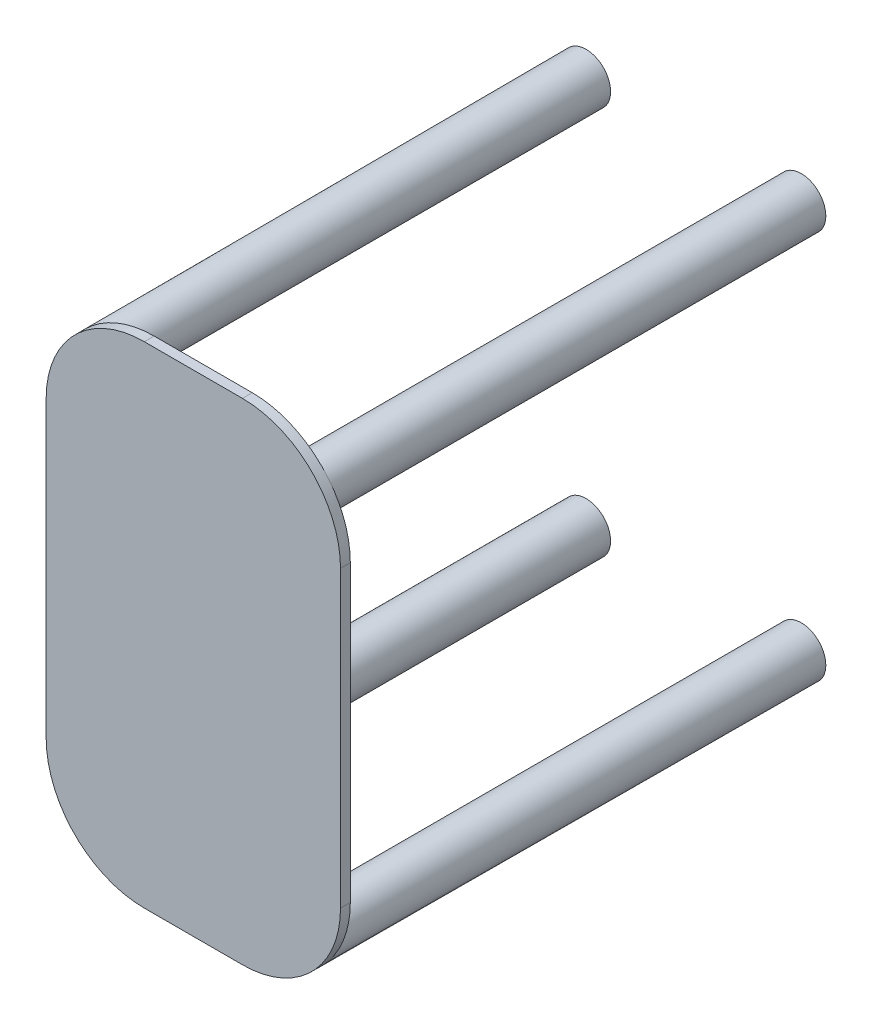
ISO-10303-21;
HEADER;
FILE_DESCRIPTION(('STEP AP214'),'2;1');
FILE_NAME('part.step','',(''),(''),'','','');
FILE_SCHEMA(('AUTOMOTIVE_DESIGN { 1 0 10303 214 1 1 1 1 }'));
ENDSEC;
DATA;
#1=APPLICATION_CONTEXT('core data for automotive mechanical design processes');
#2=APPLICATION_PROTOCOL_DEFINITION('international standard','automotive_design',2000,#1);
#3=PRODUCT_CONTEXT('',#1,'mechanical');
#4=PRODUCT('Part','Part','',(#3));
#5=PRODUCT_RELATED_PRODUCT_CATEGORY('part','',(#4));
#6=PRODUCT_DEFINITION_FORMATION('','',#4);
#7=PRODUCT_DEFINITION_CONTEXT('part definition',#1,'design');
#8=PRODUCT_DEFINITION('design','',#6,#7);
#9=PRODUCT_DEFINITION_SHAPE('','',#8);
#10=(LENGTH_UNIT() NAMED_UNIT(*) SI_UNIT(.MILLI.,.METRE.));
#11=(NAMED_UNIT(*) PLANE_ANGLE_UNIT() SI_UNIT($,.RADIAN.));
#12=(NAMED_UNIT(*) SI_UNIT($,.STERADIAN.) SOLID_ANGLE_UNIT());
#13=UNCERTAINTY_MEASURE_WITH_UNIT(LENGTH_MEASURE(1.E-05),#10,'distance_accuracy_value','');
#14=(GEOMETRIC_REPRESENTATION_CONTEXT(3) GLOBAL_UNCERTAINTY_ASSIGNED_CONTEXT((#13)) GLOBAL_UNIT_ASSIGNED_CONTEXT((#10,
#11,#12)) REPRESENTATION_CONTEXT('',''));
#15=CARTESIAN_POINT('',(0.,0.,0.));
#16=DIRECTION('',(0.,0.,1.));
#17=DIRECTION('',(1.,0.,0.));
#18=AXIS2_PLACEMENT_3D('',#15,#16,#17);
#19=CARTESIAN_POINT('',(-0.05,-0.15,0.01));
#20=DIRECTION('',(0.,0.,-1.));
#21=DIRECTION('',(-1.,0.,0.));
#22=AXIS2_PLACEMENT_3D('',#19,#20,#21);
#23=CYLINDRICAL_SURFACE('',#22,0.1);
#24=CARTESIAN_POINT('',(-0.05,-0.15,0.));
#25=DIRECTION('',(0.,0.,1.));
#26=DIRECTION('',(1.,0.,0.));
#27=AXIS2_PLACEMENT_3D('',#24,#25,#26);
#28=CIRCLE('',#27,0.1);
#29=CARTESIAN_POINT('',(-0.15,-0.15,0.));
#30=VERTEX_POINT('',#29);
#31=CARTESIAN_POINT('',(-0.133938065766945,-0.204354402906334,0.));
#32=VERTEX_POINT('',#31);
#33=EDGE_CURVE('E174',#30,#32,#28,.T.);
#34=ORIENTED_EDGE('',*,*,#33,.T.);
#35=CARTESIAN_POINT('',(-0.05,-0.15,0.));
#36=DIRECTION('',(0.,0.,1.));
#37=DIRECTION('',(-0.839380657669449,-0.543544029063335,0.));
#38=AXIS2_PLACEMENT_3D('',#35,#36,#37);
#39=CIRCLE('',#38,0.1);
#40=CARTESIAN_POINT('',(-0.120710678118655,-0.220710678118655,0.));
#41=VERTEX_POINT('',#40);
#42=EDGE_CURVE('E176',#32,#41,#39,.T.);
#43=ORIENTED_EDGE('',*,*,#42,.T.);
#44=CARTESIAN_POINT('',(-0.05,-0.25,0.));
#45=VERTEX_POINT('',#44);
#46=EDGE_CURVE('E187',#41,#45,#28,.T.);
#47=ORIENTED_EDGE('',*,*,#46,.T.);
#48=DIRECTION('',(0.,0.,-1.));
#49=VECTOR('',#48,1.);
#50=CARTESIAN_POINT('',(-0.05,-0.25,0.01));
#51=LINE('',#50,#49);
#52=CARTESIAN_POINT('',(-0.05,-0.25,0.01));
#53=VERTEX_POINT('',#52);
#54=EDGE_CURVE('E328',#53,#45,#51,.T.);
#55=ORIENTED_EDGE('',*,*,#54,.F.);
#56=CARTESIAN_POINT('',(-0.05,-0.15,0.01));
#57=DIRECTION('',(0.,0.,1.));
#58=DIRECTION('',(1.,0.,0.));
#59=AXIS2_PLACEMENT_3D('',#56,#57,#58);
#60=CIRCLE('',#59,0.1);
#61=CARTESIAN_POINT('',(-0.15,-0.15,0.01));
#62=VERTEX_POINT('',#61);
#63=EDGE_CURVE('E240',#62,#53,#60,.T.);
#64=ORIENTED_EDGE('',*,*,#63,.F.);
#65=DIRECTION('',(0.,0.,-1.));
#66=VECTOR('',#65,1.);
#67=CARTESIAN_POINT('',(-0.15,-0.15,0.01));
#68=LINE('',#67,#66);
#69=EDGE_CURVE('E180',#62,#30,#68,.T.);
#70=ORIENTED_EDGE('',*,*,#69,.T.);
#71=EDGE_LOOP('',(#34,#43,#47,#55,#64,#70));
#72=FACE_BOUND('',#71,.T.);
#73=ADVANCED_FACE('F39',(#72),#23,.T.);
#74=CARTESIAN_POINT('',(-0.05,-0.25,0.01));
#75=DIRECTION('',(0.,1.,0.));
#76=DIRECTION('',(0.,0.,1.));
#77=AXIS2_PLACEMENT_3D('',#74,#75,#76);
#78=PLANE('',#77);
#79=DIRECTION('',(1.,0.,0.));
#80=VECTOR('',#79,1.);
#81=CARTESIAN_POINT('',(-0.05,-0.25,0.));
#82=LINE('',#81,#80);
#83=CARTESIAN_POINT('',(0.0499999999999999,-0.25,0.));
#84=VERTEX_POINT('',#83);
#85=EDGE_CURVE('E148',#45,#84,#82,.T.);
#86=ORIENTED_EDGE('',*,*,#85,.T.);
#87=DIRECTION('',(0.,0.,-1.));
#88=VECTOR('',#87,1.);
#89=CARTESIAN_POINT('',(0.0499999999999999,-0.25,0.01));
#90=LINE('',#89,#88);
#91=CARTESIAN_POINT('',(0.0499999999999999,-0.25,0.01));
#92=VERTEX_POINT('',#91);
#93=EDGE_CURVE('E325',#92,#84,#90,.T.);
#94=ORIENTED_EDGE('',*,*,#93,.F.);
#95=DIRECTION('',(1.,0.,0.));
#96=VECTOR('',#95,1.);
#97=CARTESIAN_POINT('',(-0.05,-0.25,0.01));
#98=LINE('',#97,#96);
#99=EDGE_CURVE('E391',#53,#92,#98,.T.);
#100=ORIENTED_EDGE('',*,*,#99,.F.);
#101=ORIENTED_EDGE('',*,*,#54,.T.);
#102=EDGE_LOOP('',(#86,#94,#100,#101));
#103=FACE_BOUND('',#102,.T.);
#104=ADVANCED_FACE('F167',(#103),#78,.F.);
#105=CARTESIAN_POINT('',(0.0499999999999999,-0.15,0.01));
#106=DIRECTION('',(0.,0.,-1.));
#107=DIRECTION('',(-1.,0.,0.));
#108=AXIS2_PLACEMENT_3D('',#105,#106,#107);
#109=CYLINDRICAL_SURFACE('',#108,0.1);
#110=CARTESIAN_POINT('',(0.0499999999999999,-0.15,0.));
#111=DIRECTION('',(0.,0.,1.));
#112=DIRECTION('',(1.,0.,0.));
#113=AXIS2_PLACEMENT_3D('',#110,#111,#112);
#114=CIRCLE('',#113,0.1);
#115=CARTESIAN_POINT('',(0.120710678118655,-0.220710678118655,0.));
#116=VERTEX_POINT('',#115);
#117=EDGE_CURVE('E137',#84,#116,#114,.T.);
#118=ORIENTED_EDGE('',*,*,#117,.T.);
#119=CARTESIAN_POINT('',(0.0499999999999999,-0.15,0.));
#120=DIRECTION('',(0.,0.,1.));
#121=DIRECTION('',(0.707106781186548,-0.707106781186547,0.));
#122=AXIS2_PLACEMENT_3D('',#119,#120,#121);
#123=CIRCLE('',#122,0.1);
#124=CARTESIAN_POINT('',(0.133938065766945,-0.204354402906333,0.));
#125=VERTEX_POINT('',#124);
#126=EDGE_CURVE('E131',#116,#125,#123,.T.);
#127=ORIENTED_EDGE('',*,*,#126,.T.);
#128=CARTESIAN_POINT('',(0.15,-0.15,0.));
#129=VERTEX_POINT('',#128);
#130=EDGE_CURVE('E43',#125,#129,#114,.T.);
#131=ORIENTED_EDGE('',*,*,#130,.T.);
#132=DIRECTION('',(0.,0.,-1.));
#133=VECTOR('',#132,1.);
#134=CARTESIAN_POINT('',(0.15,-0.15,0.01));
#135=LINE('',#134,#133);
#136=CARTESIAN_POINT('',(0.15,-0.15,0.01));
#137=VERTEX_POINT('',#136);
#138=EDGE_CURVE('E322',#137,#129,#135,.T.);
#139=ORIENTED_EDGE('',*,*,#138,.F.);
#140=CARTESIAN_POINT('',(0.0499999999999999,-0.15,0.01));
#141=DIRECTION('',(0.,0.,1.));
#142=DIRECTION('',(1.,0.,0.));
#143=AXIS2_PLACEMENT_3D('',#140,#141,#142);
#144=CIRCLE('',#143,0.1);
#145=EDGE_CURVE('E393',#92,#137,#144,.T.);
#146=ORIENTED_EDGE('',*,*,#145,.F.);
#147=ORIENTED_EDGE('',*,*,#93,.T.);
#148=EDGE_LOOP('',(#118,#127,#131,#139,#146,#147));
#149=FACE_BOUND('',#148,.T.);
#150=ADVANCED_FACE('F133',(#149),#109,.T.);
#151=CARTESIAN_POINT('',(0.15,-0.15,0.01));
#152=DIRECTION('',(-1.,0.,0.));
#153=DIRECTION('',(0.,0.,1.));
#154=AXIS2_PLACEMENT_3D('',#151,#152,#153);
#155=PLANE('',#154);
#156=DIRECTION('',(0.,1.,0.));
#157=VECTOR('',#156,1.);
#158=CARTESIAN_POINT('',(0.15,-0.15,0.));
#159=LINE('',#158,#157);
#160=CARTESIAN_POINT('',(0.15,0.15,0.));
#161=VERTEX_POINT('',#160);
#162=EDGE_CURVE('E146',#129,#161,#159,.T.);
#163=ORIENTED_EDGE('',*,*,#162,.T.);
#164=DIRECTION('',(0.,0.,-1.));
#165=VECTOR('',#164,1.);
#166=CARTESIAN_POINT('',(0.15,0.15,0.01));
#167=LINE('',#166,#165);
#168=CARTESIAN_POINT('',(0.15,0.15,0.01));
#169=VERTEX_POINT('',#168);
#170=EDGE_CURVE('E318',#169,#161,#167,.T.);
#171=ORIENTED_EDGE('',*,*,#170,.F.);
#172=DIRECTION('',(0.,1.,0.));
#173=VECTOR('',#172,1.);
#174=CARTESIAN_POINT('',(0.15,-0.15,0.01));
#175=LINE('',#174,#173);
#176=EDGE_CURVE('E395',#137,#169,#175,.T.);
#177=ORIENTED_EDGE('',*,*,#176,.F.);
#178=ORIENTED_EDGE('',*,*,#138,.T.);
#179=EDGE_LOOP('',(#163,#171,#177,#178));
#180=FACE_BOUND('',#179,.T.);
#181=ADVANCED_FACE('F366',(#180),#155,.F.);
#182=CARTESIAN_POINT('',(0.0499999999999999,0.15,0.01));
#183=DIRECTION('',(0.,0.,-1.));
#184=DIRECTION('',(-1.,0.,0.));
#185=AXIS2_PLACEMENT_3D('',#182,#183,#184);
#186=CYLINDRICAL_SURFACE('',#185,0.1);
#187=CARTESIAN_POINT('',(0.0499999999999999,0.15,0.));
#188=DIRECTION('',(0.,0.,1.));
#189=DIRECTION('',(1.,0.,0.));
#190=AXIS2_PLACEMENT_3D('',#187,#188,#189);
#191=CIRCLE('',#190,0.1);
#192=CARTESIAN_POINT('',(0.133938065766945,0.204354402906333,0.));
#193=VERTEX_POINT('',#192);
#194=EDGE_CURVE('E340',#161,#193,#191,.T.);
#195=ORIENTED_EDGE('',*,*,#194,.T.);
#196=CARTESIAN_POINT('',(0.0499999999999999,0.15,0.));
#197=DIRECTION('',(0.,0.,1.));
#198=DIRECTION('',(0.839380657669449,0.543544029063335,0.));
#199=AXIS2_PLACEMENT_3D('',#196,#197,#198);
#200=CIRCLE('',#199,0.1);
#201=CARTESIAN_POINT('',(0.120710678118655,0.220710678118655,0.));
#202=VERTEX_POINT('',#201);
#203=EDGE_CURVE('E236',#193,#202,#200,.T.);
#204=ORIENTED_EDGE('',*,*,#203,.T.);
#205=CARTESIAN_POINT('',(0.0499999999999999,0.25,0.));
#206=VERTEX_POINT('',#205);
#207=EDGE_CURVE('E343',#202,#206,#191,.T.);
#208=ORIENTED_EDGE('',*,*,#207,.T.);
#209=DIRECTION('',(0.,0.,-1.));
#210=VECTOR('',#209,1.);
#211=CARTESIAN_POINT('',(0.0499999999999999,0.25,0.01));
#212=LINE('',#211,#210);
#213=CARTESIAN_POINT('',(0.0499999999999999,0.25,0.01));
#214=VERTEX_POINT('',#213);
#215=EDGE_CURVE('E314',#214,#206,#212,.T.);
#216=ORIENTED_EDGE('',*,*,#215,.F.);
#217=CARTESIAN_POINT('',(0.0499999999999999,0.15,0.01));
#218=DIRECTION('',(0.,0.,1.));
#219=DIRECTION('',(1.,0.,0.));
#220=AXIS2_PLACEMENT_3D('',#217,#218,#219);
#221=CIRCLE('',#220,0.1);
#222=EDGE_CURVE('E398',#169,#214,#221,.T.);
#223=ORIENTED_EDGE('',*,*,#222,.F.);
#224=ORIENTED_EDGE('',*,*,#170,.T.);
#225=EDGE_LOOP('',(#195,#204,#208,#216,#223,#224));
#226=FACE_BOUND('',#225,.T.);
#227=ADVANCED_FACE('F368',(#226),#186,.T.);
#228=CARTESIAN_POINT('',(-0.05,0.25,0.01));
#229=DIRECTION('',(0.,-1.,0.));
#230=DIRECTION('',(0.,0.,-1.));
#231=AXIS2_PLACEMENT_3D('',#228,#229,#230);
#232=PLANE('',#231);
#233=DIRECTION('',(-1.,0.,0.));
#234=VECTOR('',#233,1.);
#235=CARTESIAN_POINT('',(-0.05,0.25,0.));
#236=LINE('',#235,#234);
#237=CARTESIAN_POINT('',(-0.05,0.25,0.));
#238=VERTEX_POINT('',#237);
#239=EDGE_CURVE('E298',#206,#238,#236,.T.);
#240=ORIENTED_EDGE('',*,*,#239,.T.);
#241=DIRECTION('',(0.,0.,-1.));
#242=VECTOR('',#241,1.);
#243=CARTESIAN_POINT('',(-0.05,0.25,0.01));
#244=LINE('',#243,#242);
#245=CARTESIAN_POINT('',(-0.05,0.25,0.01));
#246=VERTEX_POINT('',#245);
#247=EDGE_CURVE('E310',#246,#238,#244,.T.);
#248=ORIENTED_EDGE('',*,*,#247,.F.);
#249=DIRECTION('',(-1.,0.,0.));
#250=VECTOR('',#249,1.);
#251=CARTESIAN_POINT('',(-0.05,0.25,0.01));
#252=LINE('',#251,#250);
#253=EDGE_CURVE('E401',#214,#246,#252,.T.);
#254=ORIENTED_EDGE('',*,*,#253,.F.);
#255=ORIENTED_EDGE('',*,*,#215,.T.);
#256=EDGE_LOOP('',(#240,#248,#254,#255));
#257=FACE_BOUND('',#256,.T.);
#258=ADVANCED_FACE('F266',(#257),#232,.F.);
#259=CARTESIAN_POINT('',(-0.05,0.15,0.01));
#260=DIRECTION('',(0.,0.,-1.));
#261=DIRECTION('',(-1.,0.,0.));
#262=AXIS2_PLACEMENT_3D('',#259,#260,#261);
#263=CYLINDRICAL_SURFACE('',#262,0.1);
#264=CARTESIAN_POINT('',(-0.05,0.15,0.));
#265=DIRECTION('',(0.,0.,1.));
#266=DIRECTION('',(-1.,0.,0.));
#267=AXIS2_PLACEMENT_3D('',#264,#265,#266);
#268=CIRCLE('',#267,0.1);
#269=CARTESIAN_POINT('',(-0.120710678118655,0.220710678118655,0.));
#270=VERTEX_POINT('',#269);
#271=EDGE_CURVE('E287',#238,#270,#268,.T.);
#272=ORIENTED_EDGE('',*,*,#271,.T.);
#273=CARTESIAN_POINT('',(-0.05,0.15,0.));
#274=DIRECTION('',(0.,0.,1.));
#275=DIRECTION('',(-0.707106781186549,0.707106781186546,0.));
#276=AXIS2_PLACEMENT_3D('',#273,#274,#275);
#277=CIRCLE('',#276,0.1);
#278=CARTESIAN_POINT('',(-0.133938065766945,0.204354402906334,0.));
#279=VERTEX_POINT('',#278);
#280=EDGE_CURVE('E293',#270,#279,#277,.T.);
#281=ORIENTED_EDGE('',*,*,#280,.T.);
#282=CARTESIAN_POINT('',(-0.15,0.15,0.));
#283=VERTEX_POINT('',#282);
#284=EDGE_CURVE('E294',#279,#283,#268,.T.);
#285=ORIENTED_EDGE('',*,*,#284,.T.);
#286=DIRECTION('',(0.,0.,-1.));
#287=VECTOR('',#286,1.);
#288=CARTESIAN_POINT('',(-0.15,0.15,0.01));
#289=LINE('',#288,#287);
#290=CARTESIAN_POINT('',(-0.15,0.15,0.01));
#291=VERTEX_POINT('',#290);
#292=EDGE_CURVE('E305',#291,#283,#289,.T.);
#293=ORIENTED_EDGE('',*,*,#292,.F.);
#294=CARTESIAN_POINT('',(-0.05,0.15,0.01));
#295=DIRECTION('',(0.,0.,1.));
#296=DIRECTION('',(-1.,0.,0.));
#297=AXIS2_PLACEMENT_3D('',#294,#295,#296);
#298=CIRCLE('',#297,0.1);
#299=EDGE_CURVE('E404',#246,#291,#298,.T.);
#300=ORIENTED_EDGE('',*,*,#299,.F.);
#301=ORIENTED_EDGE('',*,*,#247,.T.);
#302=EDGE_LOOP('',(#272,#281,#285,#293,#300,#301));
#303=FACE_BOUND('',#302,.T.);
#304=ADVANCED_FACE('F261',(#303),#263,.T.);
#305=CARTESIAN_POINT('',(-0.15,-0.15,0.01));
#306=DIRECTION('',(1.,0.,0.));
#307=DIRECTION('',(0.,0.,-1.));
#308=AXIS2_PLACEMENT_3D('',#305,#306,#307);
#309=PLANE('',#308);
#310=DIRECTION('',(0.,-1.,0.));
#311=VECTOR('',#310,1.);
#312=CARTESIAN_POINT('',(-0.15,-0.15,0.));
#313=LINE('',#312,#311);
#314=EDGE_CURVE('E292',#283,#30,#313,.T.);
#315=ORIENTED_EDGE('',*,*,#314,.T.);
#316=ORIENTED_EDGE('',*,*,#69,.F.);
#317=DIRECTION('',(0.,-1.,0.));
#318=VECTOR('',#317,1.);
#319=CARTESIAN_POINT('',(-0.15,-0.15,0.01));
#320=LINE('',#319,#318);
#321=EDGE_CURVE('E306',#291,#62,#320,.T.);
#322=ORIENTED_EDGE('',*,*,#321,.F.);
#323=ORIENTED_EDGE('',*,*,#292,.T.);
#324=EDGE_LOOP('',(#315,#316,#322,#323));
#325=FACE_BOUND('',#324,.T.);
#326=ADVANCED_FACE('F255',(#325),#309,.F.);
#327=CARTESIAN_POINT('',(-0.05,-0.15,0.01));
#328=DIRECTION('',(0.,0.,1.));
#329=DIRECTION('',(1.,0.,0.));
#330=AXIS2_PLACEMENT_3D('',#327,#328,#329);
#331=PLANE('',#330);
#332=ORIENTED_EDGE('',*,*,#63,.T.);
#333=ORIENTED_EDGE('',*,*,#99,.T.);
#334=ORIENTED_EDGE('',*,*,#145,.T.);
#335=ORIENTED_EDGE('',*,*,#176,.T.);
#336=ORIENTED_EDGE('',*,*,#222,.T.);
#337=ORIENTED_EDGE('',*,*,#253,.T.);
#338=ORIENTED_EDGE('',*,*,#299,.T.);
#339=ORIENTED_EDGE('',*,*,#321,.T.);
#340=EDGE_LOOP('',(#332,#333,#334,#335,#336,#337,#338,#339));
#341=FACE_BOUND('',#340,.T.);
#342=ADVANCED_FACE('F252',(#341),#331,.T.);
#343=CARTESIAN_POINT('',(-0.05,-0.15,0.));
#344=DIRECTION('',(0.,0.,1.));
#345=DIRECTION('',(1.,0.,0.));
#346=AXIS2_PLACEMENT_3D('',#343,#344,#345);
#347=PLANE('',#346);
#348=CARTESIAN_POINT('',(0.109689482030028,-0.198271131849266,0.));
#349=DIRECTION('',(0.,0.,1.));
#350=DIRECTION('',(1.,0.,0.));
#351=AXIS2_PLACEMENT_3D('',#348,#349,#350);
#352=CIRCLE('',#351,0.025);
#353=EDGE_CURVE('E11',#116,#125,#352,.F.);
#354=ORIENTED_EDGE('',*,*,#353,.F.);
#355=ORIENTED_EDGE('',*,*,#117,.F.);
#356=ORIENTED_EDGE('',*,*,#85,.F.);
#357=ORIENTED_EDGE('',*,*,#46,.F.);
#358=CARTESIAN_POINT('',(-0.109689482030029,-0.198271131849266,0.));
#359=DIRECTION('',(0.,0.,1.));
#360=DIRECTION('',(1.,0.,0.));
#361=AXIS2_PLACEMENT_3D('',#358,#359,#360);
#362=CIRCLE('',#361,0.025);
#363=EDGE_CURVE('E50',#32,#41,#362,.F.);
#364=ORIENTED_EDGE('',*,*,#363,.F.);
#365=ORIENTED_EDGE('',*,*,#33,.F.);
#366=ORIENTED_EDGE('',*,*,#314,.F.);
#367=ORIENTED_EDGE('',*,*,#284,.F.);
#368=CARTESIAN_POINT('',(-0.109689482030029,0.198271131849266,0.));
#369=DIRECTION('',(0.,0.,1.));
#370=DIRECTION('',(1.,0.,0.));
#371=AXIS2_PLACEMENT_3D('',#368,#369,#370);
#372=CIRCLE('',#371,0.025);
#373=EDGE_CURVE('E275',#270,#279,#372,.F.);
#374=ORIENTED_EDGE('',*,*,#373,.F.);
#375=ORIENTED_EDGE('',*,*,#271,.F.);
#376=ORIENTED_EDGE('',*,*,#239,.F.);
#377=ORIENTED_EDGE('',*,*,#207,.F.);
#378=CARTESIAN_POINT('',(0.109689482030028,0.198271131849266,0.));
#379=DIRECTION('',(0.,0.,-1.));
#380=DIRECTION('',(-1.,0.,0.));
#381=AXIS2_PLACEMENT_3D('',#378,#379,#380);
#382=CIRCLE('',#381,0.025);
#383=EDGE_CURVE('E284',#193,#202,#382,.T.);
#384=ORIENTED_EDGE('',*,*,#383,.F.);
#385=ORIENTED_EDGE('',*,*,#194,.F.);
#386=ORIENTED_EDGE('',*,*,#162,.F.);
#387=ORIENTED_EDGE('',*,*,#130,.F.);
#388=EDGE_LOOP('',(#354,#355,#356,#357,#364,#365,#366,#367,#374,#375,#376,#377,#384,#385,#386,#387));
#389=FACE_BOUND('',#388,.T.);
#390=ADVANCED_FACE('F144',(#389),#347,.F.);
#391=CARTESIAN_POINT('',(0.109689482030028,0.198271131849266,-0.5));
#392=DIRECTION('',(0.,0.,1.));
#393=DIRECTION('',(1.,0.,0.));
#394=AXIS2_PLACEMENT_3D('',#391,#392,#393);
#395=CYLINDRICAL_SURFACE('',#394,0.025);
#396=CARTESIAN_POINT('',(0.109689482030028,0.198271131849266,-0.5));
#397=DIRECTION('',(0.,0.,-1.));
#398=DIRECTION('',(-1.,0.,0.));
#399=AXIS2_PLACEMENT_3D('',#396,#397,#398);
#400=CIRCLE('',#399,0.025);
#401=CARTESIAN_POINT('',(0.0846894820300284,0.198271131849266,-0.5));
#402=VERTEX_POINT('',#401);
#403=EDGE_CURVE('E223',#402,#402,#400,.T.);
#404=ORIENTED_EDGE('',*,*,#403,.F.);
#405=EDGE_LOOP('',(#404));
#406=FACE_BOUND('',#405,.T.);
#407=ORIENTED_EDGE('',*,*,#203,.F.);
#408=ORIENTED_EDGE('',*,*,#383,.T.);
#409=EDGE_LOOP('',(#407,#408));
#410=FACE_BOUND('',#409,.T.);
#411=ADVANCED_FACE('F242',(#406,#410),#395,.T.);
#412=CARTESIAN_POINT('',(0.109689482030028,0.198271131849266,-0.5));
#413=DIRECTION('',(0.,0.,-1.));
#414=DIRECTION('',(-1.,0.,0.));
#415=AXIS2_PLACEMENT_3D('',#412,#413,#414);
#416=PLANE('',#415);
#417=ORIENTED_EDGE('',*,*,#403,.T.);
#418=EDGE_LOOP('',(#417));
#419=FACE_BOUND('',#418,.T.);
#420=ADVANCED_FACE('F215',(#419),#416,.T.);
#421=CARTESIAN_POINT('',(-0.109689482030029,0.198271131849266,-0.5));
#422=DIRECTION('',(0.,0.,1.));
#423=DIRECTION('',(1.,0.,0.));
#424=AXIS2_PLACEMENT_3D('',#421,#422,#423);
#425=CYLINDRICAL_SURFACE('',#424,0.025);
#426=CARTESIAN_POINT('',(-0.109689482030029,0.198271131849266,-0.5));
#427=DIRECTION('',(0.,0.,-1.));
#428=DIRECTION('',(1.,0.,0.));
#429=AXIS2_PLACEMENT_3D('',#426,#427,#428);
#430=CIRCLE('',#429,0.025);
#431=CARTESIAN_POINT('',(-0.0846894820300285,0.198271131849266,-0.5));
#432=VERTEX_POINT('',#431);
#433=EDGE_CURVE('E196',#432,#432,#430,.T.);
#434=ORIENTED_EDGE('',*,*,#433,.F.);
#435=EDGE_LOOP('',(#434));
#436=FACE_BOUND('',#435,.T.);
#437=ORIENTED_EDGE('',*,*,#280,.F.);
#438=ORIENTED_EDGE('',*,*,#373,.T.);
#439=EDGE_LOOP('',(#437,#438));
#440=FACE_BOUND('',#439,.T.);
#441=ADVANCED_FACE('F210',(#436,#440),#425,.T.);
#442=CARTESIAN_POINT('',(-0.109689482030029,0.198271131849266,-0.5));
#443=DIRECTION('',(0.,0.,1.));
#444=DIRECTION('',(1.,0.,0.));
#445=AXIS2_PLACEMENT_3D('',#442,#443,#444);
#446=PLANE('',#445);
#447=ORIENTED_EDGE('',*,*,#433,.T.);
#448=EDGE_LOOP('',(#447));
#449=FACE_BOUND('',#448,.T.);
#450=ADVANCED_FACE('F206',(#449),#446,.F.);
#451=CARTESIAN_POINT('',(-0.109689482030029,-0.198271131849266,-0.5));
#452=DIRECTION('',(0.,0.,1.));
#453=DIRECTION('',(1.,0.,0.));
#454=AXIS2_PLACEMENT_3D('',#451,#452,#453);
#455=CYLINDRICAL_SURFACE('',#454,0.025);
#456=CARTESIAN_POINT('',(-0.109689482030029,-0.198271131849266,-0.5));
#457=DIRECTION('',(0.,0.,-1.));
#458=DIRECTION('',(-1.,0.,0.));
#459=AXIS2_PLACEMENT_3D('',#456,#457,#458);
#460=CIRCLE('',#459,0.025);
#461=CARTESIAN_POINT('',(-0.134689482030029,-0.198271131849266,-0.5));
#462=VERTEX_POINT('',#461);
#463=EDGE_CURVE('E190',#462,#462,#460,.T.);
#464=ORIENTED_EDGE('',*,*,#463,.F.);
#465=EDGE_LOOP('',(#464));
#466=FACE_BOUND('',#465,.T.);
#467=ORIENTED_EDGE('',*,*,#42,.F.);
#468=ORIENTED_EDGE('',*,*,#363,.T.);
#469=EDGE_LOOP('',(#467,#468));
#470=FACE_BOUND('',#469,.T.);
#471=ADVANCED_FACE('F161',(#466,#470),#455,.T.);
#472=CARTESIAN_POINT('',(-0.109689482030029,-0.198271131849266,-0.5));
#473=DIRECTION('',(0.,0.,-1.));
#474=DIRECTION('',(-1.,0.,0.));
#475=AXIS2_PLACEMENT_3D('',#472,#473,#474);
#476=PLANE('',#475);
#477=ORIENTED_EDGE('',*,*,#463,.T.);
#478=EDGE_LOOP('',(#477));
#479=FACE_BOUND('',#478,.T.);
#480=ADVANCED_FACE('F152',(#479),#476,.T.);
#481=CARTESIAN_POINT('',(0.109689482030028,-0.198271131849266,-0.5));
#482=DIRECTION('',(0.,0.,1.));
#483=DIRECTION('',(1.,0.,0.));
#484=AXIS2_PLACEMENT_3D('',#481,#482,#483);
#485=CYLINDRICAL_SURFACE('',#484,0.025);
#486=CARTESIAN_POINT('',(0.109689482030028,-0.198271131849266,-0.5));
#487=DIRECTION('',(0.,0.,-1.));
#488=DIRECTION('',(1.,0.,0.));
#489=AXIS2_PLACEMENT_3D('',#486,#487,#488);
#490=CIRCLE('',#489,0.025);
#491=CARTESIAN_POINT('',(0.134689482030029,-0.198271131849266,-0.5));
#492=VERTEX_POINT('',#491);
#493=EDGE_CURVE('E437',#492,#492,#490,.T.);
#494=ORIENTED_EDGE('',*,*,#493,.F.);
#495=EDGE_LOOP('',(#494));
#496=FACE_BOUND('',#495,.T.);
#497=ORIENTED_EDGE('',*,*,#126,.F.);
#498=ORIENTED_EDGE('',*,*,#353,.T.);
#499=EDGE_LOOP('',(#497,#498));
#500=FACE_BOUND('',#499,.T.);
#501=ADVANCED_FACE('F149',(#496,#500),#485,.T.);
#502=CARTESIAN_POINT('',(0.109689482030028,-0.198271131849266,-0.5));
#503=DIRECTION('',(0.,0.,1.));
#504=DIRECTION('',(1.,0.,0.));
#505=AXIS2_PLACEMENT_3D('',#502,#503,#504);
#506=PLANE('',#505);
#507=ORIENTED_EDGE('',*,*,#493,.T.);
#508=EDGE_LOOP('',(#507));
#509=FACE_BOUND('',#508,.T.);
#510=ADVANCED_FACE('F151',(#509),#506,.F.);
#511=CLOSED_SHELL('',(#73,#104,#150,#181,#227,#258,#304,#326,#342,#390,#411,#420,#441,#450,#471,
#480,#501,#510));
#512=MANIFOLD_SOLID_BREP('B2',#511);
#513=ADVANCED_BREP_SHAPE_REPRESENTATION('',(#18,#512),#14);
#514=SHAPE_DEFINITION_REPRESENTATION(#9,#513);
ENDSEC;
END-ISO-10303-21;
